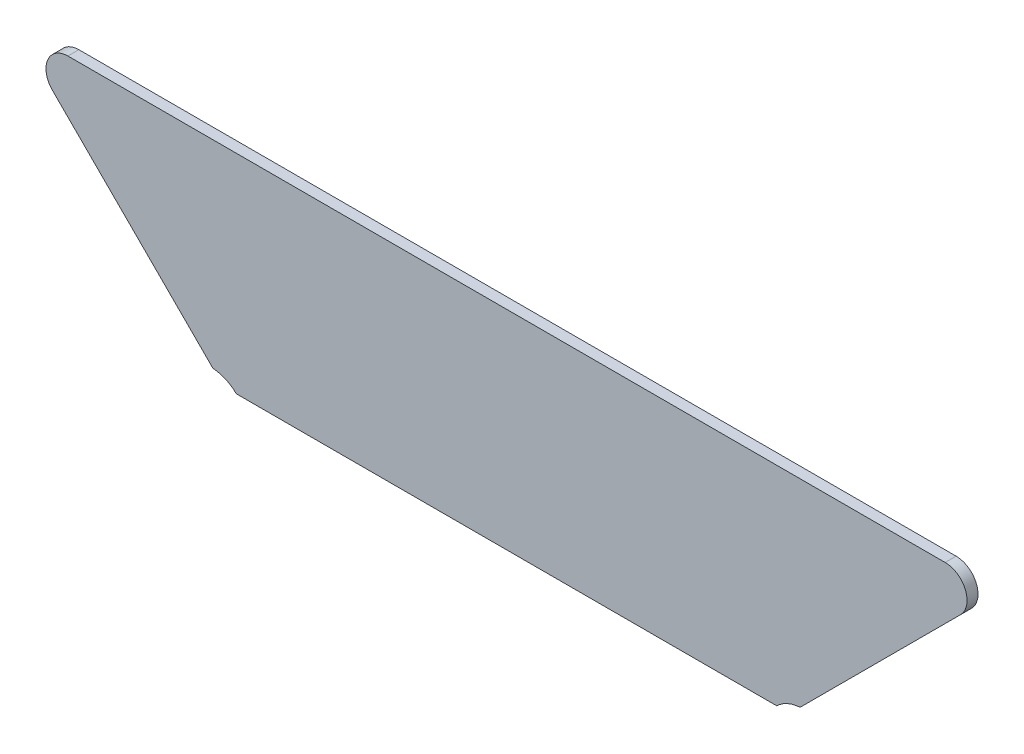
ISO-10303-21;
HEADER;
FILE_DESCRIPTION(('STEP AP214'),'2;1');
FILE_NAME('part.step','',(''),(''),'','','');
FILE_SCHEMA(('AUTOMOTIVE_DESIGN { 1 0 10303 214 1 1 1 1 }'));
ENDSEC;
DATA;
#1=APPLICATION_CONTEXT('core data for automotive mechanical design processes');
#2=APPLICATION_PROTOCOL_DEFINITION('international standard','automotive_design',2000,#1);
#3=PRODUCT_CONTEXT('',#1,'mechanical');
#4=PRODUCT('Part','Part','',(#3));
#5=PRODUCT_RELATED_PRODUCT_CATEGORY('part','',(#4));
#6=PRODUCT_DEFINITION_FORMATION('','',#4);
#7=PRODUCT_DEFINITION_CONTEXT('part definition',#1,'design');
#8=PRODUCT_DEFINITION('design','',#6,#7);
#9=PRODUCT_DEFINITION_SHAPE('','',#8);
#10=(LENGTH_UNIT() NAMED_UNIT(*) SI_UNIT(.MILLI.,.METRE.));
#11=(NAMED_UNIT(*) PLANE_ANGLE_UNIT() SI_UNIT($,.RADIAN.));
#12=(NAMED_UNIT(*) SI_UNIT($,.STERADIAN.) SOLID_ANGLE_UNIT());
#13=UNCERTAINTY_MEASURE_WITH_UNIT(LENGTH_MEASURE(1.E-05),#10,'distance_accuracy_value','');
#14=(GEOMETRIC_REPRESENTATION_CONTEXT(3) GLOBAL_UNCERTAINTY_ASSIGNED_CONTEXT((#13)) GLOBAL_UNIT_ASSIGNED_CONTEXT((#10,
#11,#12)) REPRESENTATION_CONTEXT('',''));
#15=CARTESIAN_POINT('',(0.,0.,0.));
#16=DIRECTION('',(0.,0.,1.));
#17=DIRECTION('',(1.,0.,0.));
#18=AXIS2_PLACEMENT_3D('',#15,#16,#17);
#19=CARTESIAN_POINT('',(-9.99999999999998,97.0000000000004,1.));
#20=DIRECTION('',(0.,0.,-1.));
#21=DIRECTION('',(-1.,0.,0.));
#22=AXIS2_PLACEMENT_3D('',#19,#20,#21);
#23=CYLINDRICAL_SURFACE('',#22,2.);
#24=CARTESIAN_POINT('',(-9.99999999999998,97.0000000000004,0.));
#25=DIRECTION('',(0.,0.,1.));
#26=DIRECTION('',(1.,0.,0.));
#27=AXIS2_PLACEMENT_3D('',#24,#25,#26);
#28=CIRCLE('',#27,2.);
#29=CARTESIAN_POINT('',(-8.58578643762693,95.5857864376273,0.));
#30=VERTEX_POINT('',#29);
#31=CARTESIAN_POINT('',(-10.,99.0000000000004,0.));
#32=VERTEX_POINT('',#31);
#33=EDGE_CURVE('E127',#30,#32,#28,.T.);
#34=ORIENTED_EDGE('',*,*,#33,.T.);
#35=DIRECTION('',(0.,0.,-1.));
#36=VECTOR('',#35,1.);
#37=CARTESIAN_POINT('',(-10.,99.0000000000004,1.));
#38=LINE('',#37,#36);
#39=CARTESIAN_POINT('',(-10.,99.0000000000004,1.));
#40=VERTEX_POINT('',#39);
#41=EDGE_CURVE('E11',#40,#32,#38,.T.);
#42=ORIENTED_EDGE('',*,*,#41,.F.);
#43=CARTESIAN_POINT('',(-9.99999999999998,97.0000000000004,1.));
#44=DIRECTION('',(0.,0.,1.));
#45=DIRECTION('',(1.,0.,0.));
#46=AXIS2_PLACEMENT_3D('',#43,#44,#45);
#47=CIRCLE('',#46,2.);
#48=CARTESIAN_POINT('',(-8.58578643762693,95.5857864376273,1.));
#49=VERTEX_POINT('',#48);
#50=EDGE_CURVE('E144',#49,#40,#47,.T.);
#51=ORIENTED_EDGE('',*,*,#50,.F.);
#52=DIRECTION('',(0.,0.,-1.));
#53=VECTOR('',#52,1.);
#54=CARTESIAN_POINT('',(-8.58578643762693,95.5857864376273,1.));
#55=LINE('',#54,#53);
#56=EDGE_CURVE('E123',#49,#30,#55,.T.);
#57=ORIENTED_EDGE('',*,*,#56,.T.);
#58=EDGE_LOOP('',(#34,#42,#51,#57));
#59=FACE_BOUND('',#58,.T.);
#60=ADVANCED_FACE('F33',(#59),#23,.T.);
#61=CARTESIAN_POINT('',(-10.,99.0000000000004,1.));
#62=DIRECTION('',(0.,-1.,0.));
#63=DIRECTION('',(0.,0.,-1.));
#64=AXIS2_PLACEMENT_3D('',#61,#62,#63);
#65=PLANE('',#64);
#66=DIRECTION('',(-1.,0.,0.));
#67=VECTOR('',#66,1.);
#68=CARTESIAN_POINT('',(-10.,99.0000000000004,0.));
#69=LINE('',#68,#67);
#70=CARTESIAN_POINT('',(-90.0000000000003,99.0000000000004,0.));
#71=VERTEX_POINT('',#70);
#72=EDGE_CURVE('E130',#32,#71,#69,.T.);
#73=ORIENTED_EDGE('',*,*,#72,.T.);
#74=DIRECTION('',(0.,0.,-1.));
#75=VECTOR('',#74,1.);
#76=CARTESIAN_POINT('',(-90.0000000000003,99.0000000000004,1.));
#77=LINE('',#76,#75);
#78=CARTESIAN_POINT('',(-90.0000000000003,99.0000000000004,1.));
#79=VERTEX_POINT('',#78);
#80=EDGE_CURVE('E41',#79,#71,#77,.T.);
#81=ORIENTED_EDGE('',*,*,#80,.F.);
#82=DIRECTION('',(-1.,0.,0.));
#83=VECTOR('',#82,1.);
#84=CARTESIAN_POINT('',(-10.,99.0000000000004,1.));
#85=LINE('',#84,#83);
#86=EDGE_CURVE('E88',#40,#79,#85,.T.);
#87=ORIENTED_EDGE('',*,*,#86,.F.);
#88=ORIENTED_EDGE('',*,*,#41,.T.);
#89=EDGE_LOOP('',(#73,#81,#87,#88));
#90=FACE_BOUND('',#89,.T.);
#91=ADVANCED_FACE('F176',(#90),#65,.F.);
#92=CARTESIAN_POINT('',(-90.0000000000003,97.0000000000004,1.));
#93=DIRECTION('',(0.,0.,-1.));
#94=DIRECTION('',(-1.,0.,0.));
#95=AXIS2_PLACEMENT_3D('',#92,#93,#94);
#96=CYLINDRICAL_SURFACE('',#95,2.);
#97=CARTESIAN_POINT('',(-90.0000000000003,97.0000000000004,0.));
#98=DIRECTION('',(0.,0.,1.));
#99=DIRECTION('',(1.,0.,0.));
#100=AXIS2_PLACEMENT_3D('',#97,#98,#99);
#101=CIRCLE('',#100,2.);
#102=CARTESIAN_POINT('',(-91.4142135623734,95.5857864376273,0.));
#103=VERTEX_POINT('',#102);
#104=EDGE_CURVE('E132',#71,#103,#101,.T.);
#105=ORIENTED_EDGE('',*,*,#104,.T.);
#106=DIRECTION('',(0.,0.,-1.));
#107=VECTOR('',#106,1.);
#108=CARTESIAN_POINT('',(-91.4142135623734,95.5857864376273,1.));
#109=LINE('',#108,#107);
#110=CARTESIAN_POINT('',(-91.4142135623734,95.5857864376273,1.));
#111=VERTEX_POINT('',#110);
#112=EDGE_CURVE('E150',#111,#103,#109,.T.);
#113=ORIENTED_EDGE('',*,*,#112,.F.);
#114=CARTESIAN_POINT('',(-90.0000000000003,97.0000000000004,1.));
#115=DIRECTION('',(0.,0.,1.));
#116=DIRECTION('',(1.,0.,0.));
#117=AXIS2_PLACEMENT_3D('',#114,#115,#116);
#118=CIRCLE('',#117,2.);
#119=EDGE_CURVE('E158',#79,#111,#118,.T.);
#120=ORIENTED_EDGE('',*,*,#119,.F.);
#121=ORIENTED_EDGE('',*,*,#80,.T.);
#122=EDGE_LOOP('',(#105,#113,#120,#121));
#123=FACE_BOUND('',#122,.T.);
#124=ADVANCED_FACE('F156',(#123),#96,.T.);
#125=CARTESIAN_POINT('',(-91.4142135623734,95.5857864376273,1.));
#126=DIRECTION('',(0.707106781186475,0.70710678118662,0.));
#127=DIRECTION('',(-0.70710678118662,0.707106781186475,0.));
#128=AXIS2_PLACEMENT_3D('',#125,#126,#127);
#129=PLANE('',#128);
#130=DIRECTION('',(0.70710678118662,-0.707106781186475,0.));
#131=VECTOR('',#130,1.);
#132=CARTESIAN_POINT('',(-91.4142135623734,95.5857864376273,0.));
#133=LINE('',#132,#131);
#134=CARTESIAN_POINT('',(-76.779190676188,80.9507635514448,0.));
#135=VERTEX_POINT('',#134);
#136=EDGE_CURVE('E134',#103,#135,#133,.T.);
#137=ORIENTED_EDGE('',*,*,#136,.T.);
#138=DIRECTION('',(0.,0.,-1.));
#139=VECTOR('',#138,1.);
#140=CARTESIAN_POINT('',(-76.779190676188,80.9507635514448,1.));
#141=LINE('',#140,#139);
#142=CARTESIAN_POINT('',(-76.779190676188,80.9507635514448,1.));
#143=VERTEX_POINT('',#142);
#144=EDGE_CURVE('E148',#143,#135,#141,.T.);
#145=ORIENTED_EDGE('',*,*,#144,.F.);
#146=DIRECTION('',(0.70710678118662,-0.707106781186475,0.));
#147=VECTOR('',#146,1.);
#148=CARTESIAN_POINT('',(-91.4142135623734,95.5857864376273,1.));
#149=LINE('',#148,#147);
#150=EDGE_CURVE('E168',#111,#143,#149,.T.);
#151=ORIENTED_EDGE('',*,*,#150,.F.);
#152=ORIENTED_EDGE('',*,*,#112,.T.);
#153=EDGE_LOOP('',(#137,#145,#151,#152));
#154=FACE_BOUND('',#153,.T.);
#155=ADVANCED_FACE('F166',(#154),#129,.F.);
#156=CARTESIAN_POINT('',(-77.,77.5728079546407,1.));
#157=DIRECTION('',(0.,0.,-1.));
#158=DIRECTION('',(-1.,0.,0.));
#159=AXIS2_PLACEMENT_3D('',#156,#157,#158);
#160=CYLINDRICAL_SURFACE('',#159,3.38516480713463);
#161=CARTESIAN_POINT('',(-77.,77.5728079546407,0.));
#162=DIRECTION('',(0.,0.,1.));
#163=DIRECTION('',(1.,0.,0.));
#164=AXIS2_PLACEMENT_3D('',#161,#162,#163);
#165=CIRCLE('',#164,3.38516480713463);
#166=CARTESIAN_POINT('',(-74.6403221519863,80.0000000000001,0.));
#167=VERTEX_POINT('',#166);
#168=EDGE_CURVE('E137',#167,#135,#165,.T.);
#169=ORIENTED_EDGE('',*,*,#168,.F.);
#170=DIRECTION('',(0.,0.,-1.));
#171=VECTOR('',#170,1.);
#172=CARTESIAN_POINT('',(-74.6403221519863,80.0000000000001,1.));
#173=LINE('',#172,#171);
#174=CARTESIAN_POINT('',(-74.6403221519863,80.0000000000001,1.));
#175=VERTEX_POINT('',#174);
#176=EDGE_CURVE('E119',#175,#167,#173,.T.);
#177=ORIENTED_EDGE('',*,*,#176,.F.);
#178=CARTESIAN_POINT('',(-77.,77.5728079546407,1.));
#179=DIRECTION('',(0.,0.,1.));
#180=DIRECTION('',(1.,0.,0.));
#181=AXIS2_PLACEMENT_3D('',#178,#179,#180);
#182=CIRCLE('',#181,3.38516480713463);
#183=EDGE_CURVE('E108',#175,#143,#182,.T.);
#184=ORIENTED_EDGE('',*,*,#183,.T.);
#185=ORIENTED_EDGE('',*,*,#144,.T.);
#186=EDGE_LOOP('',(#169,#177,#184,#185));
#187=FACE_BOUND('',#186,.T.);
#188=ADVANCED_FACE('F186',(#187),#160,.F.);
#189=CARTESIAN_POINT('',(-74.6403221519863,80.0000000000001,1.));
#190=DIRECTION('',(0.,1.,0.));
#191=DIRECTION('',(-1.,0.,0.));
#192=AXIS2_PLACEMENT_3D('',#189,#190,#191);
#193=PLANE('',#192);
#194=DIRECTION('',(1.,0.,0.));
#195=VECTOR('',#194,1.);
#196=CARTESIAN_POINT('',(-74.6403221519863,80.0000000000001,0.));
#197=LINE('',#196,#195);
#198=CARTESIAN_POINT('',(-25.3596778480138,80.,0.));
#199=VERTEX_POINT('',#198);
#200=EDGE_CURVE('E115',#167,#199,#197,.T.);
#201=ORIENTED_EDGE('',*,*,#200,.T.);
#202=DIRECTION('',(0.,0.,-1.));
#203=VECTOR('',#202,1.);
#204=CARTESIAN_POINT('',(-25.3596778480138,80.,1.));
#205=LINE('',#204,#203);
#206=CARTESIAN_POINT('',(-25.3596778480138,80.,1.));
#207=VERTEX_POINT('',#206);
#208=EDGE_CURVE('E112',#207,#199,#205,.T.);
#209=ORIENTED_EDGE('',*,*,#208,.F.);
#210=DIRECTION('',(1.,0.,0.));
#211=VECTOR('',#210,1.);
#212=CARTESIAN_POINT('',(-74.6403221519863,80.0000000000001,1.));
#213=LINE('',#212,#211);
#214=EDGE_CURVE('E102',#175,#207,#213,.T.);
#215=ORIENTED_EDGE('',*,*,#214,.F.);
#216=ORIENTED_EDGE('',*,*,#176,.T.);
#217=EDGE_LOOP('',(#201,#209,#215,#216));
#218=FACE_BOUND('',#217,.T.);
#219=ADVANCED_FACE('F113',(#218),#193,.F.);
#220=CARTESIAN_POINT('',(-23.,77.5728079546407,1.));
#221=DIRECTION('',(0.,0.,-1.));
#222=DIRECTION('',(-1.,0.,0.));
#223=AXIS2_PLACEMENT_3D('',#220,#221,#222);
#224=CYLINDRICAL_SURFACE('',#223,3.38516480713463);
#225=CARTESIAN_POINT('',(-23.,77.5728079546407,0.));
#226=DIRECTION('',(0.,0.,1.));
#227=DIRECTION('',(1.,0.,0.));
#228=AXIS2_PLACEMENT_3D('',#225,#226,#227);
#229=CIRCLE('',#228,3.38516480713463);
#230=CARTESIAN_POINT('',(-23.2208093238092,80.950763551445,0.));
#231=VERTEX_POINT('',#230);
#232=EDGE_CURVE('E141',#231,#199,#229,.T.);
#233=ORIENTED_EDGE('',*,*,#232,.F.);
#234=DIRECTION('',(0.,0.,-1.));
#235=VECTOR('',#234,1.);
#236=CARTESIAN_POINT('',(-23.2208093238092,80.950763551445,1.));
#237=LINE('',#236,#235);
#238=CARTESIAN_POINT('',(-23.2208093238092,80.950763551445,1.));
#239=VERTEX_POINT('',#238);
#240=EDGE_CURVE('E77',#239,#231,#237,.T.);
#241=ORIENTED_EDGE('',*,*,#240,.F.);
#242=CARTESIAN_POINT('',(-23.,77.5728079546407,1.));
#243=DIRECTION('',(0.,0.,1.));
#244=DIRECTION('',(1.,0.,0.));
#245=AXIS2_PLACEMENT_3D('',#242,#243,#244);
#246=CIRCLE('',#245,3.38516480713463);
#247=EDGE_CURVE('E106',#239,#207,#246,.T.);
#248=ORIENTED_EDGE('',*,*,#247,.T.);
#249=ORIENTED_EDGE('',*,*,#208,.T.);
#250=EDGE_LOOP('',(#233,#241,#248,#249));
#251=FACE_BOUND('',#250,.T.);
#252=ADVANCED_FACE('F121',(#251),#224,.F.);
#253=CARTESIAN_POINT('',(-23.2208093238092,80.950763551445,1.));
#254=DIRECTION('',(-0.707106781186547,0.707106781186547,0.));
#255=DIRECTION('',(-0.707106781186548,-0.707106781186548,0.));
#256=AXIS2_PLACEMENT_3D('',#253,#254,#255);
#257=PLANE('',#256);
#258=DIRECTION('',(0.707106781186547,0.707106781186547,0.));
#259=VECTOR('',#258,1.);
#260=CARTESIAN_POINT('',(-23.2208093238092,80.950763551445,0.));
#261=LINE('',#260,#259);
#262=EDGE_CURVE('E80',#231,#30,#261,.T.);
#263=ORIENTED_EDGE('',*,*,#262,.T.);
#264=ORIENTED_EDGE('',*,*,#56,.F.);
#265=DIRECTION('',(0.707106781186547,0.707106781186547,0.));
#266=VECTOR('',#265,1.);
#267=CARTESIAN_POINT('',(-23.2208093238092,80.950763551445,1.));
#268=LINE('',#267,#266);
#269=EDGE_CURVE('E49',#239,#49,#268,.T.);
#270=ORIENTED_EDGE('',*,*,#269,.F.);
#271=ORIENTED_EDGE('',*,*,#240,.T.);
#272=EDGE_LOOP('',(#263,#264,#270,#271));
#273=FACE_BOUND('',#272,.T.);
#274=ADVANCED_FACE('F194',(#273),#257,.F.);
#275=CARTESIAN_POINT('',(-9.99999999999998,97.0000000000004,1.));
#276=DIRECTION('',(0.,0.,1.));
#277=DIRECTION('',(1.,0.,0.));
#278=AXIS2_PLACEMENT_3D('',#275,#276,#277);
#279=PLANE('',#278);
#280=ORIENTED_EDGE('',*,*,#50,.T.);
#281=ORIENTED_EDGE('',*,*,#86,.T.);
#282=ORIENTED_EDGE('',*,*,#119,.T.);
#283=ORIENTED_EDGE('',*,*,#150,.T.);
#284=ORIENTED_EDGE('',*,*,#183,.F.);
#285=ORIENTED_EDGE('',*,*,#214,.T.);
#286=ORIENTED_EDGE('',*,*,#247,.F.);
#287=ORIENTED_EDGE('',*,*,#269,.T.);
#288=EDGE_LOOP('',(#280,#281,#282,#283,#284,#285,#286,#287));
#289=FACE_BOUND('',#288,.T.);
#290=ADVANCED_FACE('F104',(#289),#279,.T.);
#291=CARTESIAN_POINT('',(-9.99999999999998,97.0000000000004,0.));
#292=DIRECTION('',(0.,0.,1.));
#293=DIRECTION('',(1.,0.,0.));
#294=AXIS2_PLACEMENT_3D('',#291,#292,#293);
#295=PLANE('',#294);
#296=ORIENTED_EDGE('',*,*,#33,.F.);
#297=ORIENTED_EDGE('',*,*,#262,.F.);
#298=ORIENTED_EDGE('',*,*,#232,.T.);
#299=ORIENTED_EDGE('',*,*,#200,.F.);
#300=ORIENTED_EDGE('',*,*,#168,.T.);
#301=ORIENTED_EDGE('',*,*,#136,.F.);
#302=ORIENTED_EDGE('',*,*,#104,.F.);
#303=ORIENTED_EDGE('',*,*,#72,.F.);
#304=EDGE_LOOP('',(#296,#297,#298,#299,#300,#301,#302,#303));
#305=FACE_BOUND('',#304,.T.);
#306=ADVANCED_FACE('F162',(#305),#295,.F.);
#307=CLOSED_SHELL('',(#60,#91,#124,#155,#188,#219,#252,#274,#290,#306));
#308=MANIFOLD_SOLID_BREP('B2',#307);
#309=ADVANCED_BREP_SHAPE_REPRESENTATION('',(#18,#308),#14);
#310=SHAPE_DEFINITION_REPRESENTATION(#9,#309);
ENDSEC;
END-ISO-10303-21;
